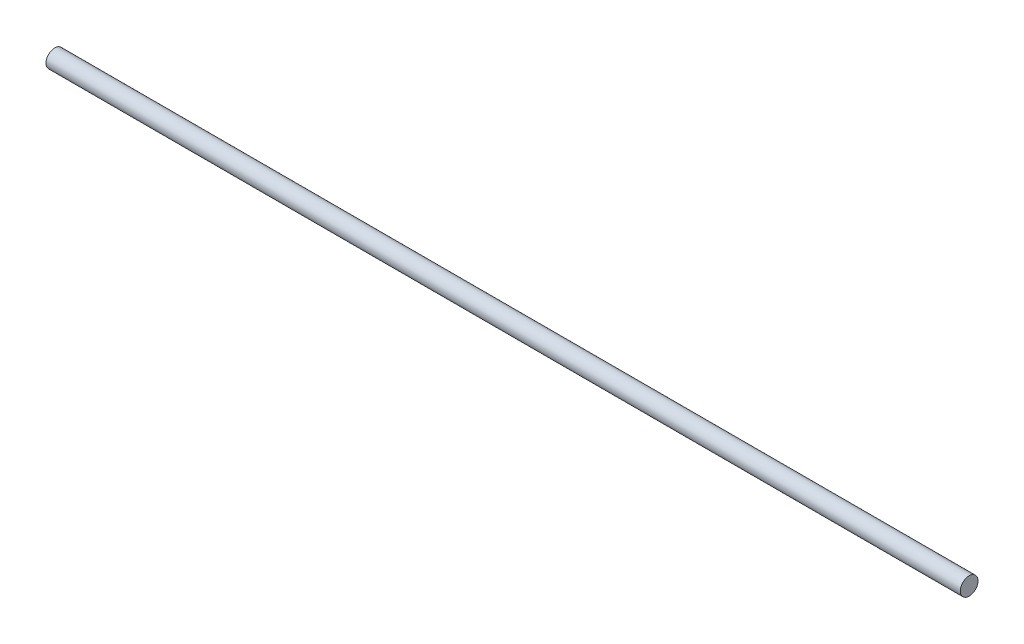
ISO-10303-21;
HEADER;
FILE_DESCRIPTION(('STEP AP214'),'2;1');
FILE_NAME('part.step','',(''),(''),'','','');
FILE_SCHEMA(('AUTOMOTIVE_DESIGN { 1 0 10303 214 1 1 1 1 }'));
ENDSEC;
DATA;
#1=APPLICATION_CONTEXT('core data for automotive mechanical design processes');
#2=APPLICATION_PROTOCOL_DEFINITION('international standard','automotive_design',2000,#1);
#3=PRODUCT_CONTEXT('',#1,'mechanical');
#4=PRODUCT('Part','Part','',(#3));
#5=PRODUCT_RELATED_PRODUCT_CATEGORY('part','',(#4));
#6=PRODUCT_DEFINITION_FORMATION('','',#4);
#7=PRODUCT_DEFINITION_CONTEXT('part definition',#1,'design');
#8=PRODUCT_DEFINITION('design','',#6,#7);
#9=PRODUCT_DEFINITION_SHAPE('','',#8);
#10=(LENGTH_UNIT() NAMED_UNIT(*) SI_UNIT(.MILLI.,.METRE.));
#11=(NAMED_UNIT(*) PLANE_ANGLE_UNIT() SI_UNIT($,.RADIAN.));
#12=(NAMED_UNIT(*) SI_UNIT($,.STERADIAN.) SOLID_ANGLE_UNIT());
#13=UNCERTAINTY_MEASURE_WITH_UNIT(LENGTH_MEASURE(1.E-05),#10,'distance_accuracy_value','');
#14=(GEOMETRIC_REPRESENTATION_CONTEXT(3) GLOBAL_UNCERTAINTY_ASSIGNED_CONTEXT((#13)) GLOBAL_UNIT_ASSIGNED_CONTEXT((#10,
#11,#12)) REPRESENTATION_CONTEXT('',''));
#15=CARTESIAN_POINT('',(0.,0.,0.));
#16=DIRECTION('',(0.,0.,1.));
#17=DIRECTION('',(1.,0.,0.));
#18=AXIS2_PLACEMENT_3D('',#15,#16,#17);
#19=CARTESIAN_POINT('',(558.8,0.,0.));
#20=DIRECTION('',(-1.,0.,0.));
#21=DIRECTION('',(0.,0.,1.));
#22=AXIS2_PLACEMENT_3D('',#19,#20,#21);
#23=CYLINDRICAL_SURFACE('',#22,10.795);
#24=CARTESIAN_POINT('',(558.8,0.,0.));
#25=DIRECTION('',(1.,0.,0.));
#26=DIRECTION('',(0.,0.,-1.));
#27=AXIS2_PLACEMENT_3D('',#24,#25,#26);
#28=CIRCLE('',#27,10.795);
#29=CARTESIAN_POINT('',(558.8,0.,-10.795));
#30=VERTEX_POINT('',#29);
#31=EDGE_CURVE('E10',#30,#30,#28,.T.);
#32=ORIENTED_EDGE('',*,*,#31,.F.);
#33=EDGE_LOOP('',(#32));
#34=FACE_BOUND('',#33,.T.);
#35=CARTESIAN_POINT('',(-558.8,0.,0.));
#36=DIRECTION('',(1.,0.,0.));
#37=DIRECTION('',(0.,0.,-1.));
#38=AXIS2_PLACEMENT_3D('',#35,#36,#37);
#39=CIRCLE('',#38,10.795);
#40=CARTESIAN_POINT('',(-558.8,0.,-10.795));
#41=VERTEX_POINT('',#40);
#42=EDGE_CURVE('E35',#41,#41,#39,.T.);
#43=ORIENTED_EDGE('',*,*,#42,.T.);
#44=EDGE_LOOP('',(#43));
#45=FACE_BOUND('',#44,.T.);
#46=ADVANCED_FACE('F32',(#34,#45),#23,.T.);
#47=CARTESIAN_POINT('',(558.8,0.,0.));
#48=DIRECTION('',(1.,0.,0.));
#49=DIRECTION('',(0.,0.,-1.));
#50=AXIS2_PLACEMENT_3D('',#47,#48,#49);
#51=PLANE('',#50);
#52=ORIENTED_EDGE('',*,*,#31,.T.);
#53=EDGE_LOOP('',(#52));
#54=FACE_BOUND('',#53,.T.);
#55=ADVANCED_FACE('F47',(#54),#51,.T.);
#56=CARTESIAN_POINT('',(-558.8,0.,0.));
#57=DIRECTION('',(1.,0.,0.));
#58=DIRECTION('',(0.,0.,-1.));
#59=AXIS2_PLACEMENT_3D('',#56,#57,#58);
#60=PLANE('',#59);
#61=ORIENTED_EDGE('',*,*,#42,.F.);
#62=EDGE_LOOP('',(#61));
#63=FACE_BOUND('',#62,.T.);
#64=ADVANCED_FACE('F45',(#63),#60,.F.);
#65=CLOSED_SHELL('',(#46,#55,#64));
#66=MANIFOLD_SOLID_BREP('B2',#65);
#67=ADVANCED_BREP_SHAPE_REPRESENTATION('',(#18,#66),#14);
#68=SHAPE_DEFINITION_REPRESENTATION(#9,#67);
ENDSEC;
END-ISO-10303-21;
